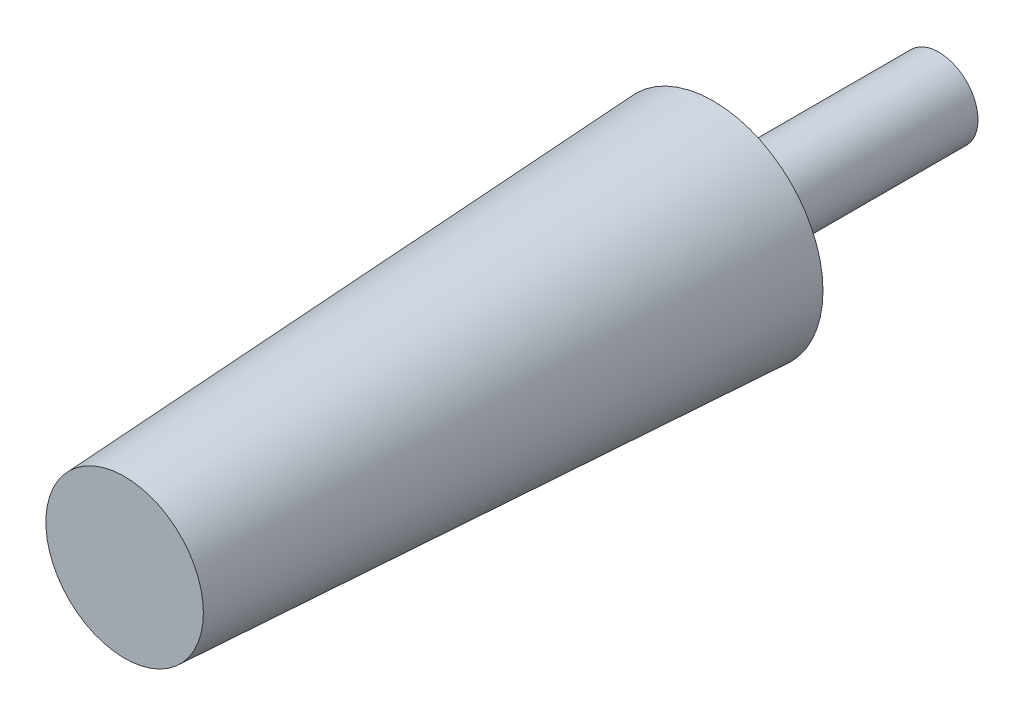
ISO-10303-21;
HEADER;
FILE_DESCRIPTION(('STEP AP214'),'2;1');
FILE_NAME('part.step','',(''),(''),'','','');
FILE_SCHEMA(('AUTOMOTIVE_DESIGN { 1 0 10303 214 1 1 1 1 }'));
ENDSEC;
DATA;
#1=APPLICATION_CONTEXT('core data for automotive mechanical design processes');
#2=APPLICATION_PROTOCOL_DEFINITION('international standard','automotive_design',2000,#1);
#3=PRODUCT_CONTEXT('',#1,'mechanical');
#4=PRODUCT('Part','Part','',(#3));
#5=PRODUCT_RELATED_PRODUCT_CATEGORY('part','',(#4));
#6=PRODUCT_DEFINITION_FORMATION('','',#4);
#7=PRODUCT_DEFINITION_CONTEXT('part definition',#1,'design');
#8=PRODUCT_DEFINITION('design','',#6,#7);
#9=PRODUCT_DEFINITION_SHAPE('','',#8);
#10=(LENGTH_UNIT() NAMED_UNIT(*) SI_UNIT(.MILLI.,.METRE.));
#11=(NAMED_UNIT(*) PLANE_ANGLE_UNIT() SI_UNIT($,.RADIAN.));
#12=(NAMED_UNIT(*) SI_UNIT($,.STERADIAN.) SOLID_ANGLE_UNIT());
#13=UNCERTAINTY_MEASURE_WITH_UNIT(LENGTH_MEASURE(1.E-05),#10,'distance_accuracy_value','');
#14=(GEOMETRIC_REPRESENTATION_CONTEXT(3) GLOBAL_UNCERTAINTY_ASSIGNED_CONTEXT((#13)) GLOBAL_UNIT_ASSIGNED_CONTEXT((#10,
#11,#12)) REPRESENTATION_CONTEXT('',''));
#15=CARTESIAN_POINT('',(0.,0.,0.));
#16=DIRECTION('',(0.,0.,1.));
#17=DIRECTION('',(1.,0.,0.));
#18=AXIS2_PLACEMENT_3D('',#15,#16,#17);
#19=CARTESIAN_POINT('',(0.,0.,22.86));
#20=DIRECTION('',(0.,0.,-1.));
#21=DIRECTION('',(-1.,0.,0.));
#22=AXIS2_PLACEMENT_3D('',#19,#20,#21);
#23=CYLINDRICAL_SURFACE('',#22,3.96875);
#24=CARTESIAN_POINT('',(0.,0.,22.86));
#25=DIRECTION('',(0.,0.,1.));
#26=DIRECTION('',(1.,0.,0.));
#27=AXIS2_PLACEMENT_3D('',#24,#25,#26);
#28=CIRCLE('',#27,3.96875);
#29=CARTESIAN_POINT('',(3.96875,0.,22.86));
#30=VERTEX_POINT('',#29);
#31=EDGE_CURVE('E10',#30,#30,#28,.T.);
#32=ORIENTED_EDGE('',*,*,#31,.F.);
#33=EDGE_LOOP('',(#32));
#34=FACE_BOUND('',#33,.T.);
#35=CARTESIAN_POINT('',(0.,0.,0.));
#36=DIRECTION('',(0.,0.,1.));
#37=DIRECTION('',(1.,0.,0.));
#38=AXIS2_PLACEMENT_3D('',#35,#36,#37);
#39=CIRCLE('',#38,3.96875);
#40=CARTESIAN_POINT('',(3.96875,0.,0.));
#41=VERTEX_POINT('',#40);
#42=EDGE_CURVE('E40',#41,#41,#39,.T.);
#43=ORIENTED_EDGE('',*,*,#42,.T.);
#44=EDGE_LOOP('',(#43));
#45=FACE_BOUND('',#44,.T.);
#46=ADVANCED_FACE('F37',(#34,#45),#23,.T.);
#47=CARTESIAN_POINT('',(0.,0.,0.));
#48=DIRECTION('',(0.,0.,1.));
#49=DIRECTION('',(1.,0.,0.));
#50=AXIS2_PLACEMENT_3D('',#47,#48,#49);
#51=PLANE('',#50);
#52=ORIENTED_EDGE('',*,*,#42,.F.);
#53=EDGE_LOOP('',(#52));
#54=FACE_BOUND('',#53,.T.);
#55=ADVANCED_FACE('F72',(#54),#51,.F.);
#56=CARTESIAN_POINT('',(0.,0.,22.86));
#57=DIRECTION('',(0.,0.,-1.));
#58=DIRECTION('',(1.,0.,0.));
#59=AXIS2_PLACEMENT_3D('',#56,#57,#58);
#60=CONICAL_SURFACE('',#59,11.1125,0.05235987755983);
#61=CARTESIAN_POINT('',(0.,0.,82.55));
#62=DIRECTION('',(0.,0.,1.));
#63=DIRECTION('',(1.,0.,0.));
#64=AXIS2_PLACEMENT_3D('',#61,#62,#63);
#65=CIRCLE('',#64,7.98427965459526);
#66=CARTESIAN_POINT('',(7.98427965459526,0.,82.55));
#67=VERTEX_POINT('',#66);
#68=EDGE_CURVE('E49',#67,#67,#65,.T.);
#69=ORIENTED_EDGE('',*,*,#68,.F.);
#70=EDGE_LOOP('',(#69));
#71=FACE_BOUND('',#70,.T.);
#72=CARTESIAN_POINT('',(0.,0.,22.86));
#73=DIRECTION('',(0.,0.,1.));
#74=DIRECTION('',(1.,0.,0.));
#75=AXIS2_PLACEMENT_3D('',#72,#73,#74);
#76=CIRCLE('',#75,11.1125);
#77=CARTESIAN_POINT('',(11.1125,0.,22.86));
#78=VERTEX_POINT('',#77);
#79=EDGE_CURVE('E54',#78,#78,#76,.T.);
#80=ORIENTED_EDGE('',*,*,#79,.T.);
#81=EDGE_LOOP('',(#80));
#82=FACE_BOUND('',#81,.T.);
#83=ADVANCED_FACE('F59',(#71,#82),#60,.T.);
#84=CARTESIAN_POINT('',(0.,0.,82.55));
#85=DIRECTION('',(0.,0.,1.));
#86=DIRECTION('',(1.,0.,0.));
#87=AXIS2_PLACEMENT_3D('',#84,#85,#86);
#88=PLANE('',#87);
#89=ORIENTED_EDGE('',*,*,#68,.T.);
#90=EDGE_LOOP('',(#89));
#91=FACE_BOUND('',#90,.T.);
#92=ADVANCED_FACE('F63',(#91),#88,.T.);
#93=CARTESIAN_POINT('',(0.,0.,22.86));
#94=DIRECTION('',(0.,0.,1.));
#95=DIRECTION('',(1.,0.,0.));
#96=AXIS2_PLACEMENT_3D('',#93,#94,#95);
#97=PLANE('',#96);
#98=ORIENTED_EDGE('',*,*,#31,.T.);
#99=EDGE_LOOP('',(#98));
#100=FACE_BOUND('',#99,.T.);
#101=ORIENTED_EDGE('',*,*,#79,.F.);
#102=EDGE_LOOP('',(#101));
#103=FACE_BOUND('',#102,.T.);
#104=ADVANCED_FACE('F61',(#100,#103),#97,.F.);
#105=CLOSED_SHELL('',(#46,#55,#83,#92,#104));
#106=MANIFOLD_SOLID_BREP('B2',#105);
#107=ADVANCED_BREP_SHAPE_REPRESENTATION('',(#18,#106),#14);
#108=SHAPE_DEFINITION_REPRESENTATION(#9,#107);
ENDSEC;
END-ISO-10303-21;
